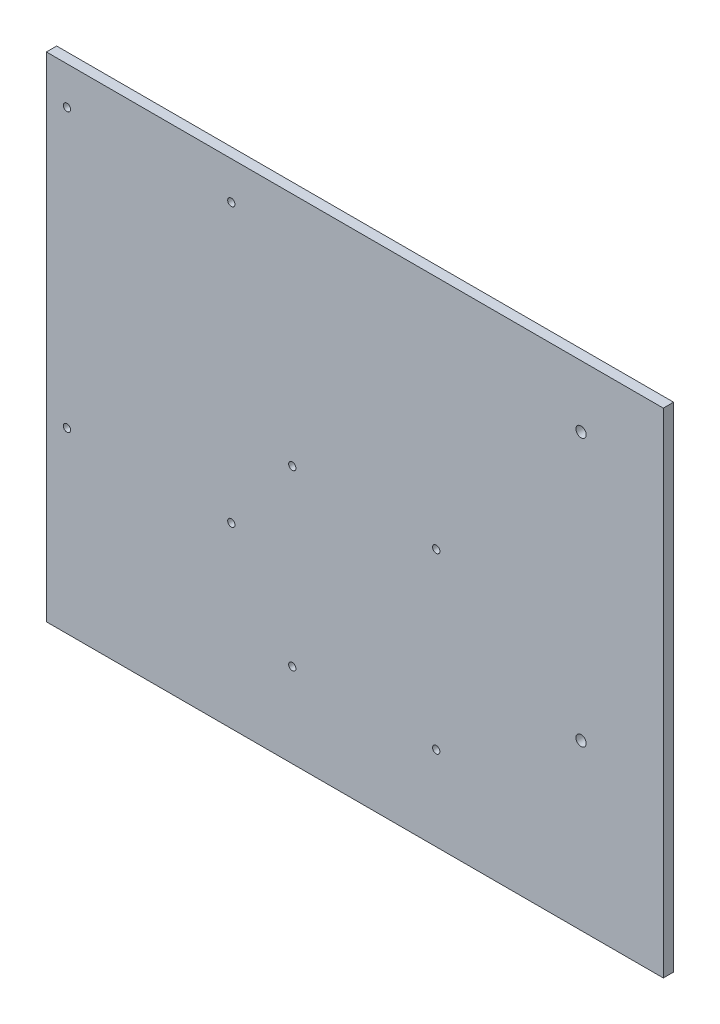
ISO-10303-21;
HEADER;
FILE_DESCRIPTION(('STEP AP214'),'2;1');
FILE_NAME('part.step','',(''),(''),'','','');
FILE_SCHEMA(('AUTOMOTIVE_DESIGN { 1 0 10303 214 1 1 1 1 }'));
ENDSEC;
DATA;
#1=APPLICATION_CONTEXT('core data for automotive mechanical design processes');
#2=APPLICATION_PROTOCOL_DEFINITION('international standard','automotive_design',2000,#1);
#3=PRODUCT_CONTEXT('',#1,'mechanical');
#4=PRODUCT('Part','Part','',(#3));
#5=PRODUCT_RELATED_PRODUCT_CATEGORY('part','',(#4));
#6=PRODUCT_DEFINITION_FORMATION('','',#4);
#7=PRODUCT_DEFINITION_CONTEXT('part definition',#1,'design');
#8=PRODUCT_DEFINITION('design','',#6,#7);
#9=PRODUCT_DEFINITION_SHAPE('','',#8);
#10=(LENGTH_UNIT() NAMED_UNIT(*) SI_UNIT(.MILLI.,.METRE.));
#11=(NAMED_UNIT(*) PLANE_ANGLE_UNIT() SI_UNIT($,.RADIAN.));
#12=(NAMED_UNIT(*) SI_UNIT($,.STERADIAN.) SOLID_ANGLE_UNIT());
#13=UNCERTAINTY_MEASURE_WITH_UNIT(LENGTH_MEASURE(1.E-05),#10,'distance_accuracy_value','');
#14=(GEOMETRIC_REPRESENTATION_CONTEXT(3) GLOBAL_UNCERTAINTY_ASSIGNED_CONTEXT((#13)) GLOBAL_UNIT_ASSIGNED_CONTEXT((#10,
#11,#12)) REPRESENTATION_CONTEXT('',''));
#15=CARTESIAN_POINT('',(0.,0.,0.));
#16=DIRECTION('',(0.,0.,1.));
#17=DIRECTION('',(1.,0.,0.));
#18=AXIS2_PLACEMENT_3D('',#15,#16,#17);
#19=CARTESIAN_POINT('',(0.,0.,6.35));
#20=DIRECTION('',(1.,0.,0.));
#21=DIRECTION('',(0.,0.,-1.));
#22=AXIS2_PLACEMENT_3D('',#19,#20,#21);
#23=PLANE('',#22);
#24=DIRECTION('',(0.,-1.,0.));
#25=VECTOR('',#24,1.);
#26=CARTESIAN_POINT('',(0.,0.,0.));
#27=LINE('',#26,#25);
#28=CARTESIAN_POINT('',(0.,304.8,0.));
#29=VERTEX_POINT('',#28);
#30=CARTESIAN_POINT('',(0.,0.,0.));
#31=VERTEX_POINT('',#30);
#32=EDGE_CURVE('E96',#29,#31,#27,.T.);
#33=ORIENTED_EDGE('',*,*,#32,.T.);
#34=DIRECTION('',(0.,0.,-1.));
#35=VECTOR('',#34,1.);
#36=CARTESIAN_POINT('',(0.,0.,6.35));
#37=LINE('',#36,#35);
#38=CARTESIAN_POINT('',(0.,0.,6.35));
#39=VERTEX_POINT('',#38);
#40=EDGE_CURVE('E11',#39,#31,#37,.T.);
#41=ORIENTED_EDGE('',*,*,#40,.F.);
#42=DIRECTION('',(0.,-1.,0.));
#43=VECTOR('',#42,1.);
#44=CARTESIAN_POINT('',(0.,0.,6.35));
#45=LINE('',#44,#43);
#46=CARTESIAN_POINT('',(0.,304.8,6.35));
#47=VERTEX_POINT('',#46);
#48=EDGE_CURVE('E84',#47,#39,#45,.T.);
#49=ORIENTED_EDGE('',*,*,#48,.F.);
#50=DIRECTION('',(0.,0.,-1.));
#51=VECTOR('',#50,1.);
#52=CARTESIAN_POINT('',(0.,304.8,6.35));
#53=LINE('',#52,#51);
#54=EDGE_CURVE('E92',#47,#29,#53,.T.);
#55=ORIENTED_EDGE('',*,*,#54,.T.);
#56=EDGE_LOOP('',(#33,#41,#49,#55));
#57=FACE_BOUND('',#56,.T.);
#58=ADVANCED_FACE('F33',(#57),#23,.F.);
#59=CARTESIAN_POINT('',(0.,0.,6.35));
#60=DIRECTION('',(0.,1.,0.));
#61=DIRECTION('',(0.,0.,1.));
#62=AXIS2_PLACEMENT_3D('',#59,#60,#61);
#63=PLANE('',#62);
#64=DIRECTION('',(1.,0.,0.));
#65=VECTOR('',#64,1.);
#66=CARTESIAN_POINT('',(0.,0.,0.));
#67=LINE('',#66,#65);
#68=CARTESIAN_POINT('',(381.,0.,0.));
#69=VERTEX_POINT('',#68);
#70=EDGE_CURVE('E88',#31,#69,#67,.T.);
#71=ORIENTED_EDGE('',*,*,#70,.T.);
#72=DIRECTION('',(0.,0.,-1.));
#73=VECTOR('',#72,1.);
#74=CARTESIAN_POINT('',(381.,0.,6.35));
#75=LINE('',#74,#73);
#76=CARTESIAN_POINT('',(381.,0.,6.35));
#77=VERTEX_POINT('',#76);
#78=EDGE_CURVE('E41',#77,#69,#75,.T.);
#79=ORIENTED_EDGE('',*,*,#78,.F.);
#80=DIRECTION('',(1.,0.,0.));
#81=VECTOR('',#80,1.);
#82=CARTESIAN_POINT('',(0.,0.,6.35));
#83=LINE('',#82,#81);
#84=EDGE_CURVE('E79',#39,#77,#83,.T.);
#85=ORIENTED_EDGE('',*,*,#84,.F.);
#86=ORIENTED_EDGE('',*,*,#40,.T.);
#87=EDGE_LOOP('',(#71,#79,#85,#86));
#88=FACE_BOUND('',#87,.T.);
#89=ADVANCED_FACE('F87',(#88),#63,.F.);
#90=CARTESIAN_POINT('',(381.,0.,6.35));
#91=DIRECTION('',(-1.,0.,0.));
#92=DIRECTION('',(0.,0.,1.));
#93=AXIS2_PLACEMENT_3D('',#90,#91,#92);
#94=PLANE('',#93);
#95=DIRECTION('',(0.,1.,0.));
#96=VECTOR('',#95,1.);
#97=CARTESIAN_POINT('',(381.,0.,0.));
#98=LINE('',#97,#96);
#99=CARTESIAN_POINT('',(381.,304.8,0.));
#100=VERTEX_POINT('',#99);
#101=EDGE_CURVE('E66',#69,#100,#98,.T.);
#102=ORIENTED_EDGE('',*,*,#101,.T.);
#103=DIRECTION('',(0.,0.,-1.));
#104=VECTOR('',#103,1.);
#105=CARTESIAN_POINT('',(381.,304.8,6.35));
#106=LINE('',#105,#104);
#107=CARTESIAN_POINT('',(381.,304.8,6.35));
#108=VERTEX_POINT('',#107);
#109=EDGE_CURVE('E89',#108,#100,#106,.T.);
#110=ORIENTED_EDGE('',*,*,#109,.F.);
#111=DIRECTION('',(0.,1.,0.));
#112=VECTOR('',#111,1.);
#113=CARTESIAN_POINT('',(381.,0.,6.35));
#114=LINE('',#113,#112);
#115=EDGE_CURVE('E82',#77,#108,#114,.T.);
#116=ORIENTED_EDGE('',*,*,#115,.F.);
#117=ORIENTED_EDGE('',*,*,#78,.T.);
#118=EDGE_LOOP('',(#102,#110,#116,#117));
#119=FACE_BOUND('',#118,.T.);
#120=ADVANCED_FACE('F90',(#119),#94,.F.);
#121=CARTESIAN_POINT('',(0.,304.8,6.35));
#122=DIRECTION('',(0.,-1.,0.));
#123=DIRECTION('',(0.,0.,-1.));
#124=AXIS2_PLACEMENT_3D('',#121,#122,#123);
#125=PLANE('',#124);
#126=DIRECTION('',(-1.,0.,0.));
#127=VECTOR('',#126,1.);
#128=CARTESIAN_POINT('',(0.,304.8,0.));
#129=LINE('',#128,#127);
#130=EDGE_CURVE('E72',#100,#29,#129,.T.);
#131=ORIENTED_EDGE('',*,*,#130,.T.);
#132=ORIENTED_EDGE('',*,*,#54,.F.);
#133=DIRECTION('',(-1.,0.,0.));
#134=VECTOR('',#133,1.);
#135=CARTESIAN_POINT('',(0.,304.8,6.35));
#136=LINE('',#135,#134);
#137=EDGE_CURVE('E49',#108,#47,#136,.T.);
#138=ORIENTED_EDGE('',*,*,#137,.F.);
#139=ORIENTED_EDGE('',*,*,#109,.T.);
#140=EDGE_LOOP('',(#131,#132,#138,#139));
#141=FACE_BOUND('',#140,.T.);
#142=ADVANCED_FACE('F104',(#141),#125,.F.);
#143=CARTESIAN_POINT('',(0.,0.,6.35));
#144=DIRECTION('',(0.,0.,-1.));
#145=DIRECTION('',(-1.,0.,0.));
#146=AXIS2_PLACEMENT_3D('',#143,#144,#145);
#147=PLANE('',#146);
#148=CARTESIAN_POINT('',(240.746130572645,159.199501388795,6.34999999999999));
#149=DIRECTION('',(0.,0.,1.));
#150=DIRECTION('',(1.,0.,0.));
#151=AXIS2_PLACEMENT_3D('',#148,#149,#150);
#152=CIRCLE('',#151,2.25424999999936);
#153=CARTESIAN_POINT('',(243.000380572644,159.199501388795,6.34999999999999));
#154=VERTEX_POINT('',#153);
#155=EDGE_CURVE('E164',#154,#154,#152,.T.);
#156=ORIENTED_EDGE('',*,*,#155,.F.);
#157=EDGE_LOOP('',(#156));
#158=FACE_BOUND('',#157,.T.);
#159=CARTESIAN_POINT('',(151.846130572646,52.0166010585392,6.34999999999999));
#160=DIRECTION('',(0.,0.,1.));
#161=DIRECTION('',(1.,0.,0.));
#162=AXIS2_PLACEMENT_3D('',#159,#160,#161);
#163=CIRCLE('',#162,2.25424999999937);
#164=CARTESIAN_POINT('',(154.100380572645,52.0166010585392,6.34999999999999));
#165=VERTEX_POINT('',#164);
#166=EDGE_CURVE('E158',#165,#165,#163,.T.);
#167=ORIENTED_EDGE('',*,*,#166,.F.);
#168=EDGE_LOOP('',(#167));
#169=FACE_BOUND('',#168,.T.);
#170=CARTESIAN_POINT('',(240.746130572646,52.01660105854,6.34999999999999));
#171=DIRECTION('',(0.,0.,1.));
#172=DIRECTION('',(1.,0.,0.));
#173=AXIS2_PLACEMENT_3D('',#170,#171,#172);
#174=CIRCLE('',#173,2.25424999999937);
#175=CARTESIAN_POINT('',(243.000380572645,52.01660105854,6.34999999999999));
#176=VERTEX_POINT('',#175);
#177=EDGE_CURVE('E152',#176,#176,#174,.T.);
#178=ORIENTED_EDGE('',*,*,#177,.F.);
#179=EDGE_LOOP('',(#178));
#180=FACE_BOUND('',#179,.T.);
#181=CARTESIAN_POINT('',(151.846130572645,159.199501388795,6.34999999999999));
#182=DIRECTION('',(0.,0.,1.));
#183=DIRECTION('',(1.,0.,0.));
#184=AXIS2_PLACEMENT_3D('',#181,#182,#183);
#185=CIRCLE('',#184,2.25424999999933);
#186=CARTESIAN_POINT('',(154.100380572644,159.199501388795,6.34999999999999));
#187=VERTEX_POINT('',#186);
#188=EDGE_CURVE('E146',#187,#187,#185,.T.);
#189=ORIENTED_EDGE('',*,*,#188,.F.);
#190=EDGE_LOOP('',(#189));
#191=FACE_BOUND('',#190,.T.);
#192=CARTESIAN_POINT('',(330.2,266.7,6.35));
#193=DIRECTION('',(0.,0.,1.));
#194=DIRECTION('',(1.,0.,0.));
#195=AXIS2_PLACEMENT_3D('',#192,#193,#194);
#196=CIRCLE('',#195,3.17499999999997);
#197=CARTESIAN_POINT('',(333.375,266.7,6.35));
#198=VERTEX_POINT('',#197);
#199=EDGE_CURVE('E140',#198,#198,#196,.T.);
#200=ORIENTED_EDGE('',*,*,#199,.F.);
#201=EDGE_LOOP('',(#200));
#202=FACE_BOUND('',#201,.T.);
#203=CARTESIAN_POINT('',(330.2,101.6,6.35));
#204=DIRECTION('',(0.,0.,1.));
#205=DIRECTION('',(1.,0.,0.));
#206=AXIS2_PLACEMENT_3D('',#203,#204,#205);
#207=CIRCLE('',#206,3.17499999999997);
#208=CARTESIAN_POINT('',(333.375,101.6,6.35));
#209=VERTEX_POINT('',#208);
#210=EDGE_CURVE('E134',#209,#209,#207,.T.);
#211=ORIENTED_EDGE('',*,*,#210,.F.);
#212=EDGE_LOOP('',(#211));
#213=FACE_BOUND('',#212,.T.);
#214=CARTESIAN_POINT('',(12.7,110.,6.35));
#215=DIRECTION('',(0.,0.,1.));
#216=DIRECTION('',(1.,0.,0.));
#217=AXIS2_PLACEMENT_3D('',#214,#215,#216);
#218=CIRCLE('',#217,2.25);
#219=CARTESIAN_POINT('',(14.95,110.,6.35));
#220=VERTEX_POINT('',#219);
#221=EDGE_CURVE('E130',#220,#220,#218,.T.);
#222=ORIENTED_EDGE('',*,*,#221,.F.);
#223=EDGE_LOOP('',(#222));
#224=FACE_BOUND('',#223,.T.);
#225=CARTESIAN_POINT('',(114.2,110.,6.35));
#226=DIRECTION('',(0.,0.,1.));
#227=DIRECTION('',(1.,0.,0.));
#228=AXIS2_PLACEMENT_3D('',#225,#226,#227);
#229=CIRCLE('',#228,2.25);
#230=CARTESIAN_POINT('',(116.45,110.,6.35));
#231=VERTEX_POINT('',#230);
#232=EDGE_CURVE('E124',#231,#231,#229,.T.);
#233=ORIENTED_EDGE('',*,*,#232,.F.);
#234=EDGE_LOOP('',(#233));
#235=FACE_BOUND('',#234,.T.);
#236=CARTESIAN_POINT('',(12.7,281.5,6.35));
#237=DIRECTION('',(0.,0.,1.));
#238=DIRECTION('',(1.,0.,0.));
#239=AXIS2_PLACEMENT_3D('',#236,#237,#238);
#240=CIRCLE('',#239,2.25);
#241=CARTESIAN_POINT('',(14.95,281.5,6.35));
#242=VERTEX_POINT('',#241);
#243=EDGE_CURVE('E118',#242,#242,#240,.T.);
#244=ORIENTED_EDGE('',*,*,#243,.F.);
#245=EDGE_LOOP('',(#244));
#246=FACE_BOUND('',#245,.T.);
#247=CARTESIAN_POINT('',(114.2,281.5,6.35));
#248=DIRECTION('',(0.,0.,1.));
#249=DIRECTION('',(1.,0.,0.));
#250=AXIS2_PLACEMENT_3D('',#247,#248,#249);
#251=CIRCLE('',#250,2.25);
#252=CARTESIAN_POINT('',(116.45,281.5,6.35));
#253=VERTEX_POINT('',#252);
#254=EDGE_CURVE('E112',#253,#253,#251,.T.);
#255=ORIENTED_EDGE('',*,*,#254,.F.);
#256=EDGE_LOOP('',(#255));
#257=FACE_BOUND('',#256,.T.);
#258=ORIENTED_EDGE('',*,*,#48,.T.);
#259=ORIENTED_EDGE('',*,*,#84,.T.);
#260=ORIENTED_EDGE('',*,*,#115,.T.);
#261=ORIENTED_EDGE('',*,*,#137,.T.);
#262=EDGE_LOOP('',(#258,#259,#260,#261));
#263=FACE_BOUND('',#262,.T.);
#264=ADVANCED_FACE('F80',(#158,#169,#180,#191,#202,#213,#224,#235,#246,#257,#263),#147,.F.);
#265=CARTESIAN_POINT('',(0.,0.,0.));
#266=DIRECTION('',(0.,0.,-1.));
#267=DIRECTION('',(-1.,0.,0.));
#268=AXIS2_PLACEMENT_3D('',#265,#266,#267);
#269=PLANE('',#268);
#270=CARTESIAN_POINT('',(240.746130572645,159.199501388795,0.));
#271=DIRECTION('',(0.,0.,1.));
#272=DIRECTION('',(1.,0.,0.));
#273=AXIS2_PLACEMENT_3D('',#270,#271,#272);
#274=CIRCLE('',#273,2.25424999999936);
#275=CARTESIAN_POINT('',(243.000380572644,159.199501388795,0.));
#276=VERTEX_POINT('',#275);
#277=EDGE_CURVE('E149',#276,#276,#274,.T.);
#278=ORIENTED_EDGE('',*,*,#277,.T.);
#279=EDGE_LOOP('',(#278));
#280=FACE_BOUND('',#279,.T.);
#281=CARTESIAN_POINT('',(151.846130572646,52.0166010585392,0.));
#282=DIRECTION('',(0.,0.,1.));
#283=DIRECTION('',(1.,0.,0.));
#284=AXIS2_PLACEMENT_3D('',#281,#282,#283);
#285=CIRCLE('',#284,2.25424999999937);
#286=CARTESIAN_POINT('',(154.100380572645,52.0166010585392,0.));
#287=VERTEX_POINT('',#286);
#288=EDGE_CURVE('E161',#287,#287,#285,.T.);
#289=ORIENTED_EDGE('',*,*,#288,.T.);
#290=EDGE_LOOP('',(#289));
#291=FACE_BOUND('',#290,.T.);
#292=CARTESIAN_POINT('',(240.746130572646,52.01660105854,0.));
#293=DIRECTION('',(0.,0.,1.));
#294=DIRECTION('',(1.,0.,0.));
#295=AXIS2_PLACEMENT_3D('',#292,#293,#294);
#296=CIRCLE('',#295,2.25424999999937);
#297=CARTESIAN_POINT('',(243.000380572645,52.01660105854,0.));
#298=VERTEX_POINT('',#297);
#299=EDGE_CURVE('E155',#298,#298,#296,.T.);
#300=ORIENTED_EDGE('',*,*,#299,.T.);
#301=EDGE_LOOP('',(#300));
#302=FACE_BOUND('',#301,.T.);
#303=CARTESIAN_POINT('',(151.846130572645,159.199501388795,0.));
#304=DIRECTION('',(0.,0.,1.));
#305=DIRECTION('',(1.,0.,0.));
#306=AXIS2_PLACEMENT_3D('',#303,#304,#305);
#307=CIRCLE('',#306,2.25424999999933);
#308=CARTESIAN_POINT('',(154.100380572644,159.199501388795,0.));
#309=VERTEX_POINT('',#308);
#310=EDGE_CURVE('E143',#309,#309,#307,.T.);
#311=ORIENTED_EDGE('',*,*,#310,.T.);
#312=EDGE_LOOP('',(#311));
#313=FACE_BOUND('',#312,.T.);
#314=CARTESIAN_POINT('',(330.2,266.7,0.));
#315=DIRECTION('',(0.,0.,1.));
#316=DIRECTION('',(1.,0.,0.));
#317=AXIS2_PLACEMENT_3D('',#314,#315,#316);
#318=CIRCLE('',#317,3.17499999999997);
#319=CARTESIAN_POINT('',(333.375,266.7,0.));
#320=VERTEX_POINT('',#319);
#321=EDGE_CURVE('E137',#320,#320,#318,.T.);
#322=ORIENTED_EDGE('',*,*,#321,.T.);
#323=EDGE_LOOP('',(#322));
#324=FACE_BOUND('',#323,.T.);
#325=CARTESIAN_POINT('',(330.2,101.6,0.));
#326=DIRECTION('',(0.,0.,1.));
#327=DIRECTION('',(1.,0.,0.));
#328=AXIS2_PLACEMENT_3D('',#325,#326,#327);
#329=CIRCLE('',#328,3.17499999999997);
#330=CARTESIAN_POINT('',(333.375,101.6,0.));
#331=VERTEX_POINT('',#330);
#332=EDGE_CURVE('E133',#331,#331,#329,.T.);
#333=ORIENTED_EDGE('',*,*,#332,.T.);
#334=EDGE_LOOP('',(#333));
#335=FACE_BOUND('',#334,.T.);
#336=CARTESIAN_POINT('',(12.7,110.,0.));
#337=DIRECTION('',(0.,0.,1.));
#338=DIRECTION('',(1.,0.,0.));
#339=AXIS2_PLACEMENT_3D('',#336,#337,#338);
#340=CIRCLE('',#339,2.25);
#341=CARTESIAN_POINT('',(14.95,110.,0.));
#342=VERTEX_POINT('',#341);
#343=EDGE_CURVE('E127',#342,#342,#340,.T.);
#344=ORIENTED_EDGE('',*,*,#343,.T.);
#345=EDGE_LOOP('',(#344));
#346=FACE_BOUND('',#345,.T.);
#347=CARTESIAN_POINT('',(114.2,110.,0.));
#348=DIRECTION('',(0.,0.,1.));
#349=DIRECTION('',(1.,0.,0.));
#350=AXIS2_PLACEMENT_3D('',#347,#348,#349);
#351=CIRCLE('',#350,2.25);
#352=CARTESIAN_POINT('',(116.45,110.,0.));
#353=VERTEX_POINT('',#352);
#354=EDGE_CURVE('E121',#353,#353,#351,.T.);
#355=ORIENTED_EDGE('',*,*,#354,.T.);
#356=EDGE_LOOP('',(#355));
#357=FACE_BOUND('',#356,.T.);
#358=CARTESIAN_POINT('',(12.7,281.5,0.));
#359=DIRECTION('',(0.,0.,1.));
#360=DIRECTION('',(1.,0.,0.));
#361=AXIS2_PLACEMENT_3D('',#358,#359,#360);
#362=CIRCLE('',#361,2.25);
#363=CARTESIAN_POINT('',(14.95,281.5,0.));
#364=VERTEX_POINT('',#363);
#365=EDGE_CURVE('E115',#364,#364,#362,.T.);
#366=ORIENTED_EDGE('',*,*,#365,.T.);
#367=EDGE_LOOP('',(#366));
#368=FACE_BOUND('',#367,.T.);
#369=CARTESIAN_POINT('',(114.2,281.5,0.));
#370=DIRECTION('',(0.,0.,1.));
#371=DIRECTION('',(1.,0.,0.));
#372=AXIS2_PLACEMENT_3D('',#369,#370,#371);
#373=CIRCLE('',#372,2.25);
#374=CARTESIAN_POINT('',(116.45,281.5,0.));
#375=VERTEX_POINT('',#374);
#376=EDGE_CURVE('E99',#375,#375,#373,.T.);
#377=ORIENTED_EDGE('',*,*,#376,.T.);
#378=EDGE_LOOP('',(#377));
#379=FACE_BOUND('',#378,.T.);
#380=ORIENTED_EDGE('',*,*,#32,.F.);
#381=ORIENTED_EDGE('',*,*,#130,.F.);
#382=ORIENTED_EDGE('',*,*,#101,.F.);
#383=ORIENTED_EDGE('',*,*,#70,.F.);
#384=EDGE_LOOP('',(#380,#381,#382,#383));
#385=FACE_BOUND('',#384,.T.);
#386=ADVANCED_FACE('F107',(#280,#291,#302,#313,#324,#335,#346,#357,#368,#379,#385),#269,.T.);
#387=CARTESIAN_POINT('',(114.2,281.5,6.35));
#388=DIRECTION('',(0.,0.,1.));
#389=DIRECTION('',(1.,0.,0.));
#390=AXIS2_PLACEMENT_3D('',#387,#388,#389);
#391=CYLINDRICAL_SURFACE('',#390,2.25);
#392=ORIENTED_EDGE('',*,*,#376,.F.);
#393=EDGE_LOOP('',(#392));
#394=FACE_BOUND('',#393,.T.);
#395=ORIENTED_EDGE('',*,*,#254,.T.);
#396=EDGE_LOOP('',(#395));
#397=FACE_BOUND('',#396,.T.);
#398=ADVANCED_FACE('F200',(#394,#397),#391,.F.);
#399=CARTESIAN_POINT('',(12.7,281.5,6.35));
#400=DIRECTION('',(0.,0.,1.));
#401=DIRECTION('',(1.,0.,0.));
#402=AXIS2_PLACEMENT_3D('',#399,#400,#401);
#403=CYLINDRICAL_SURFACE('',#402,2.25);
#404=ORIENTED_EDGE('',*,*,#365,.F.);
#405=EDGE_LOOP('',(#404));
#406=FACE_BOUND('',#405,.T.);
#407=ORIENTED_EDGE('',*,*,#243,.T.);
#408=EDGE_LOOP('',(#407));
#409=FACE_BOUND('',#408,.T.);
#410=ADVANCED_FACE('F202',(#406,#409),#403,.F.);
#411=CARTESIAN_POINT('',(114.2,110.,6.35));
#412=DIRECTION('',(0.,0.,1.));
#413=DIRECTION('',(1.,0.,0.));
#414=AXIS2_PLACEMENT_3D('',#411,#412,#413);
#415=CYLINDRICAL_SURFACE('',#414,2.25);
#416=ORIENTED_EDGE('',*,*,#354,.F.);
#417=EDGE_LOOP('',(#416));
#418=FACE_BOUND('',#417,.T.);
#419=ORIENTED_EDGE('',*,*,#232,.T.);
#420=EDGE_LOOP('',(#419));
#421=FACE_BOUND('',#420,.T.);
#422=ADVANCED_FACE('F209',(#418,#421),#415,.F.);
#423=CARTESIAN_POINT('',(12.7,110.,6.35));
#424=DIRECTION('',(0.,0.,1.));
#425=DIRECTION('',(1.,0.,0.));
#426=AXIS2_PLACEMENT_3D('',#423,#424,#425);
#427=CYLINDRICAL_SURFACE('',#426,2.25);
#428=ORIENTED_EDGE('',*,*,#343,.F.);
#429=EDGE_LOOP('',(#428));
#430=FACE_BOUND('',#429,.T.);
#431=ORIENTED_EDGE('',*,*,#221,.T.);
#432=EDGE_LOOP('',(#431));
#433=FACE_BOUND('',#432,.T.);
#434=ADVANCED_FACE('F290',(#430,#433),#427,.F.);
#435=CARTESIAN_POINT('',(330.2,101.6,0.));
#436=DIRECTION('',(0.,0.,1.));
#437=DIRECTION('',(1.,0.,0.));
#438=AXIS2_PLACEMENT_3D('',#435,#436,#437);
#439=CYLINDRICAL_SURFACE('',#438,3.17499999999997);
#440=ORIENTED_EDGE('',*,*,#332,.F.);
#441=EDGE_LOOP('',(#440));
#442=FACE_BOUND('',#441,.T.);
#443=ORIENTED_EDGE('',*,*,#210,.T.);
#444=EDGE_LOOP('',(#443));
#445=FACE_BOUND('',#444,.T.);
#446=ADVANCED_FACE('F286',(#442,#445),#439,.F.);
#447=CARTESIAN_POINT('',(330.2,266.7,0.));
#448=DIRECTION('',(0.,0.,1.));
#449=DIRECTION('',(1.,0.,0.));
#450=AXIS2_PLACEMENT_3D('',#447,#448,#449);
#451=CYLINDRICAL_SURFACE('',#450,3.17499999999997);
#452=ORIENTED_EDGE('',*,*,#321,.F.);
#453=EDGE_LOOP('',(#452));
#454=FACE_BOUND('',#453,.T.);
#455=ORIENTED_EDGE('',*,*,#199,.T.);
#456=EDGE_LOOP('',(#455));
#457=FACE_BOUND('',#456,.T.);
#458=ADVANCED_FACE('F251',(#454,#457),#451,.F.);
#459=CARTESIAN_POINT('',(151.846130572645,159.199501388795,0.));
#460=DIRECTION('',(0.,0.,1.));
#461=DIRECTION('',(1.,0.,0.));
#462=AXIS2_PLACEMENT_3D('',#459,#460,#461);
#463=CYLINDRICAL_SURFACE('',#462,2.25424999999933);
#464=ORIENTED_EDGE('',*,*,#310,.F.);
#465=EDGE_LOOP('',(#464));
#466=FACE_BOUND('',#465,.T.);
#467=ORIENTED_EDGE('',*,*,#188,.T.);
#468=EDGE_LOOP('',(#467));
#469=FACE_BOUND('',#468,.T.);
#470=ADVANCED_FACE('F245',(#466,#469),#463,.F.);
#471=CARTESIAN_POINT('',(240.746130572646,52.01660105854,0.));
#472=DIRECTION('',(0.,0.,1.));
#473=DIRECTION('',(1.,0.,0.));
#474=AXIS2_PLACEMENT_3D('',#471,#472,#473);
#475=CYLINDRICAL_SURFACE('',#474,2.25424999999937);
#476=ORIENTED_EDGE('',*,*,#299,.F.);
#477=EDGE_LOOP('',(#476));
#478=FACE_BOUND('',#477,.T.);
#479=ORIENTED_EDGE('',*,*,#177,.T.);
#480=EDGE_LOOP('',(#479));
#481=FACE_BOUND('',#480,.T.);
#482=ADVANCED_FACE('F250',(#478,#481),#475,.F.);
#483=CARTESIAN_POINT('',(151.846130572646,52.0166010585392,0.));
#484=DIRECTION('',(0.,0.,1.));
#485=DIRECTION('',(1.,0.,0.));
#486=AXIS2_PLACEMENT_3D('',#483,#484,#485);
#487=CYLINDRICAL_SURFACE('',#486,2.25424999999937);
#488=ORIENTED_EDGE('',*,*,#288,.F.);
#489=EDGE_LOOP('',(#488));
#490=FACE_BOUND('',#489,.T.);
#491=ORIENTED_EDGE('',*,*,#166,.T.);
#492=EDGE_LOOP('',(#491));
#493=FACE_BOUND('',#492,.T.);
#494=ADVANCED_FACE('F175',(#490,#493),#487,.F.);
#495=CARTESIAN_POINT('',(240.746130572645,159.199501388795,0.));
#496=DIRECTION('',(0.,0.,1.));
#497=DIRECTION('',(1.,0.,0.));
#498=AXIS2_PLACEMENT_3D('',#495,#496,#497);
#499=CYLINDRICAL_SURFACE('',#498,2.25424999999936);
#500=ORIENTED_EDGE('',*,*,#277,.F.);
#501=EDGE_LOOP('',(#500));
#502=FACE_BOUND('',#501,.T.);
#503=ORIENTED_EDGE('',*,*,#155,.T.);
#504=EDGE_LOOP('',(#503));
#505=FACE_BOUND('',#504,.T.);
#506=ADVANCED_FACE('F172',(#502,#505),#499,.F.);
#507=CLOSED_SHELL('',(#58,#89,#120,#142,#264,#386,#398,#410,#422,#434,#446,#458,#470,#482,#494,#506));
#508=MANIFOLD_SOLID_BREP('B2',#507);
#509=ADVANCED_BREP_SHAPE_REPRESENTATION('',(#18,#508),#14);
#510=SHAPE_DEFINITION_REPRESENTATION(#9,#509);
ENDSEC;
END-ISO-10303-21;
